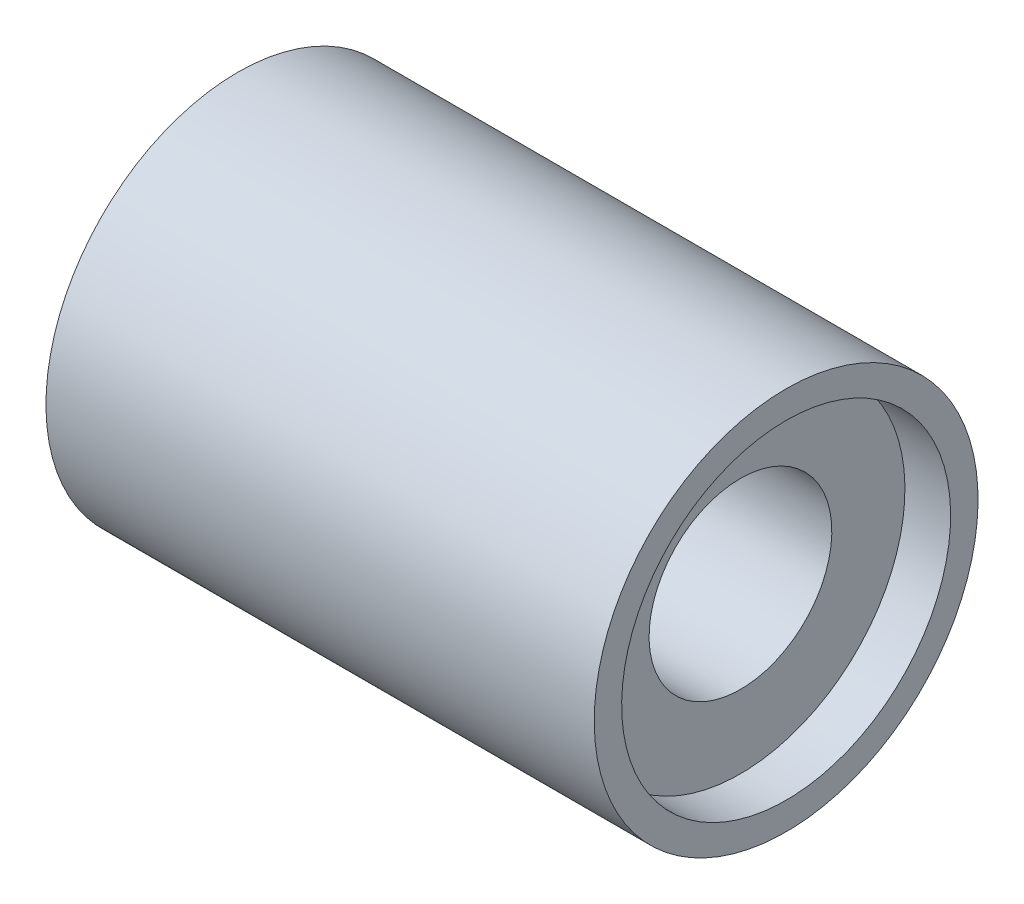
ISO-10303-21;
HEADER;
FILE_DESCRIPTION(('STEP AP214'),'2;1');
FILE_NAME('part.step','',(''),(''),'','','');
FILE_SCHEMA(('AUTOMOTIVE_DESIGN { 1 0 10303 214 1 1 1 1 }'));
ENDSEC;
DATA;
#1=APPLICATION_CONTEXT('core data for automotive mechanical design processes');
#2=APPLICATION_PROTOCOL_DEFINITION('international standard','automotive_design',2000,#1);
#3=PRODUCT_CONTEXT('',#1,'mechanical');
#4=PRODUCT('Part','Part','',(#3));
#5=PRODUCT_RELATED_PRODUCT_CATEGORY('part','',(#4));
#6=PRODUCT_DEFINITION_FORMATION('','',#4);
#7=PRODUCT_DEFINITION_CONTEXT('part definition',#1,'design');
#8=PRODUCT_DEFINITION('design','',#6,#7);
#9=PRODUCT_DEFINITION_SHAPE('','',#8);
#10=(LENGTH_UNIT() NAMED_UNIT(*) SI_UNIT(.MILLI.,.METRE.));
#11=(NAMED_UNIT(*) PLANE_ANGLE_UNIT() SI_UNIT($,.RADIAN.));
#12=(NAMED_UNIT(*) SI_UNIT($,.STERADIAN.) SOLID_ANGLE_UNIT());
#13=UNCERTAINTY_MEASURE_WITH_UNIT(LENGTH_MEASURE(1.E-05),#10,'distance_accuracy_value','');
#14=(GEOMETRIC_REPRESENTATION_CONTEXT(3) GLOBAL_UNCERTAINTY_ASSIGNED_CONTEXT((#13)) GLOBAL_UNIT_ASSIGNED_CONTEXT((#10,
#11,#12)) REPRESENTATION_CONTEXT('',''));
#15=CARTESIAN_POINT('',(0.,0.,0.));
#16=DIRECTION('',(0.,0.,1.));
#17=DIRECTION('',(1.,0.,0.));
#18=AXIS2_PLACEMENT_3D('',#15,#16,#17);
#19=CARTESIAN_POINT('',(-6.,3.,0.));
#20=DIRECTION('',(-1.,0.,0.));
#21=DIRECTION('',(0.,-1.,0.));
#22=AXIS2_PLACEMENT_3D('',#19,#20,#21);
#23=PLANE('',#22);
#24=CARTESIAN_POINT('',(-6.,0.,0.));
#25=DIRECTION('',(1.,0.,0.));
#26=DIRECTION('',(0.,1.,0.));
#27=AXIS2_PLACEMENT_3D('',#24,#25,#26);
#28=CIRCLE('',#27,3.);
#29=CARTESIAN_POINT('',(-6.,3.,0.));
#30=VERTEX_POINT('',#29);
#31=EDGE_CURVE('E73',#30,#30,#28,.T.);
#32=ORIENTED_EDGE('',*,*,#31,.T.);
#33=EDGE_LOOP('',(#32));
#34=FACE_BOUND('',#33,.T.);
#35=CARTESIAN_POINT('',(-6.,0.,0.));
#36=DIRECTION('',(1.,0.,0.));
#37=DIRECTION('',(0.,1.,0.));
#38=AXIS2_PLACEMENT_3D('',#35,#36,#37);
#39=CIRCLE('',#38,4.2);
#40=CARTESIAN_POINT('',(-6.,4.2,0.));
#41=VERTEX_POINT('',#40);
#42=EDGE_CURVE('E10',#41,#41,#39,.T.);
#43=ORIENTED_EDGE('',*,*,#42,.F.);
#44=EDGE_LOOP('',(#43));
#45=FACE_BOUND('',#44,.T.);
#46=ADVANCED_FACE('F38',(#34,#45),#23,.T.);
#47=CARTESIAN_POINT('',(0.,0.,0.));
#48=DIRECTION('',(1.,0.,0.));
#49=DIRECTION('',(0.,1.,0.));
#50=AXIS2_PLACEMENT_3D('',#47,#48,#49);
#51=CYLINDRICAL_SURFACE('',#50,4.2);
#52=ORIENTED_EDGE('',*,*,#42,.T.);
#53=EDGE_LOOP('',(#52));
#54=FACE_BOUND('',#53,.T.);
#55=CARTESIAN_POINT('',(6.,0.,0.));
#56=DIRECTION('',(1.,0.,0.));
#57=DIRECTION('',(0.,1.,0.));
#58=AXIS2_PLACEMENT_3D('',#55,#56,#57);
#59=CIRCLE('',#58,4.2);
#60=CARTESIAN_POINT('',(6.,4.2,0.));
#61=VERTEX_POINT('',#60);
#62=EDGE_CURVE('E45',#61,#61,#59,.T.);
#63=ORIENTED_EDGE('',*,*,#62,.F.);
#64=EDGE_LOOP('',(#63));
#65=FACE_BOUND('',#64,.T.);
#66=ADVANCED_FACE('F92',(#54,#65),#51,.T.);
#67=CARTESIAN_POINT('',(6.,4.2,0.));
#68=DIRECTION('',(1.,0.,0.));
#69=DIRECTION('',(0.,1.,0.));
#70=AXIS2_PLACEMENT_3D('',#67,#68,#69);
#71=PLANE('',#70);
#72=ORIENTED_EDGE('',*,*,#62,.T.);
#73=EDGE_LOOP('',(#72));
#74=FACE_BOUND('',#73,.T.);
#75=CARTESIAN_POINT('',(6.,0.,0.));
#76=DIRECTION('',(1.,0.,0.));
#77=DIRECTION('',(0.,1.,0.));
#78=AXIS2_PLACEMENT_3D('',#75,#76,#77);
#79=CIRCLE('',#78,3.6);
#80=CARTESIAN_POINT('',(6.,3.6,0.));
#81=VERTEX_POINT('',#80);
#82=EDGE_CURVE('E51',#81,#81,#79,.T.);
#83=ORIENTED_EDGE('',*,*,#82,.F.);
#84=EDGE_LOOP('',(#83));
#85=FACE_BOUND('',#84,.T.);
#86=ADVANCED_FACE('F96',(#74,#85),#71,.T.);
#87=CARTESIAN_POINT('',(0.,0.,0.));
#88=DIRECTION('',(1.,0.,0.));
#89=DIRECTION('',(0.,1.,0.));
#90=AXIS2_PLACEMENT_3D('',#87,#88,#89);
#91=CYLINDRICAL_SURFACE('',#90,3.6);
#92=ORIENTED_EDGE('',*,*,#82,.T.);
#93=EDGE_LOOP('',(#92));
#94=FACE_BOUND('',#93,.T.);
#95=CARTESIAN_POINT('',(5.,0.,0.));
#96=DIRECTION('',(1.,0.,0.));
#97=DIRECTION('',(0.,1.,0.));
#98=AXIS2_PLACEMENT_3D('',#95,#96,#97);
#99=CIRCLE('',#98,3.6);
#100=CARTESIAN_POINT('',(5.,3.6,0.));
#101=VERTEX_POINT('',#100);
#102=EDGE_CURVE('E57',#101,#101,#99,.T.);
#103=ORIENTED_EDGE('',*,*,#102,.F.);
#104=EDGE_LOOP('',(#103));
#105=FACE_BOUND('',#104,.T.);
#106=ADVANCED_FACE('F100',(#94,#105),#91,.F.);
#107=CARTESIAN_POINT('',(5.,3.6,0.));
#108=DIRECTION('',(1.,0.,0.));
#109=DIRECTION('',(0.,1.,0.));
#110=AXIS2_PLACEMENT_3D('',#107,#108,#109);
#111=PLANE('',#110);
#112=ORIENTED_EDGE('',*,*,#102,.T.);
#113=EDGE_LOOP('',(#112));
#114=FACE_BOUND('',#113,.T.);
#115=CARTESIAN_POINT('',(5.,0.,0.));
#116=DIRECTION('',(1.,0.,0.));
#117=DIRECTION('',(0.,1.,0.));
#118=AXIS2_PLACEMENT_3D('',#115,#116,#117);
#119=CIRCLE('',#118,2.);
#120=CARTESIAN_POINT('',(5.,2.,0.));
#121=VERTEX_POINT('',#120);
#122=EDGE_CURVE('E63',#121,#121,#119,.T.);
#123=ORIENTED_EDGE('',*,*,#122,.F.);
#124=EDGE_LOOP('',(#123));
#125=FACE_BOUND('',#124,.T.);
#126=ADVANCED_FACE('F106',(#114,#125),#111,.T.);
#127=CARTESIAN_POINT('',(0.,0.,0.));
#128=DIRECTION('',(1.,0.,0.));
#129=DIRECTION('',(0.,1.,0.));
#130=AXIS2_PLACEMENT_3D('',#127,#128,#129);
#131=CYLINDRICAL_SURFACE('',#130,2.);
#132=ORIENTED_EDGE('',*,*,#122,.T.);
#133=EDGE_LOOP('',(#132));
#134=FACE_BOUND('',#133,.T.);
#135=CARTESIAN_POINT('',(-5.,0.,0.));
#136=DIRECTION('',(1.,0.,0.));
#137=DIRECTION('',(0.,1.,0.));
#138=AXIS2_PLACEMENT_3D('',#135,#136,#137);
#139=CIRCLE('',#138,2.);
#140=CARTESIAN_POINT('',(-5.,2.,0.));
#141=VERTEX_POINT('',#140);
#142=EDGE_CURVE('E66',#141,#141,#139,.T.);
#143=ORIENTED_EDGE('',*,*,#142,.F.);
#144=EDGE_LOOP('',(#143));
#145=FACE_BOUND('',#144,.T.);
#146=ADVANCED_FACE('F88',(#134,#145),#131,.F.);
#147=CARTESIAN_POINT('',(-5.,3.,0.));
#148=DIRECTION('',(-1.,0.,0.));
#149=DIRECTION('',(0.,-1.,0.));
#150=AXIS2_PLACEMENT_3D('',#147,#148,#149);
#151=PLANE('',#150);
#152=ORIENTED_EDGE('',*,*,#142,.T.);
#153=EDGE_LOOP('',(#152));
#154=FACE_BOUND('',#153,.T.);
#155=CARTESIAN_POINT('',(-5.,0.,0.));
#156=DIRECTION('',(1.,0.,0.));
#157=DIRECTION('',(0.,1.,0.));
#158=AXIS2_PLACEMENT_3D('',#155,#156,#157);
#159=CIRCLE('',#158,3.);
#160=CARTESIAN_POINT('',(-5.,3.,0.));
#161=VERTEX_POINT('',#160);
#162=EDGE_CURVE('E69',#161,#161,#159,.T.);
#163=ORIENTED_EDGE('',*,*,#162,.F.);
#164=EDGE_LOOP('',(#163));
#165=FACE_BOUND('',#164,.T.);
#166=ADVANCED_FACE('F82',(#154,#165),#151,.T.);
#167=CARTESIAN_POINT('',(0.,0.,0.));
#168=DIRECTION('',(1.,0.,0.));
#169=DIRECTION('',(0.,1.,0.));
#170=AXIS2_PLACEMENT_3D('',#167,#168,#169);
#171=CYLINDRICAL_SURFACE('',#170,3.);
#172=ORIENTED_EDGE('',*,*,#162,.T.);
#173=EDGE_LOOP('',(#172));
#174=FACE_BOUND('',#173,.T.);
#175=ORIENTED_EDGE('',*,*,#31,.F.);
#176=EDGE_LOOP('',(#175));
#177=FACE_BOUND('',#176,.T.);
#178=ADVANCED_FACE('F80',(#174,#177),#171,.F.);
#179=CLOSED_SHELL('',(#46,#66,#86,#106,#126,#146,#166,#178));
#180=MANIFOLD_SOLID_BREP('B2',#179);
#181=ADVANCED_BREP_SHAPE_REPRESENTATION('',(#18,#180),#14);
#182=SHAPE_DEFINITION_REPRESENTATION(#9,#181);
ENDSEC;
END-ISO-10303-21;
